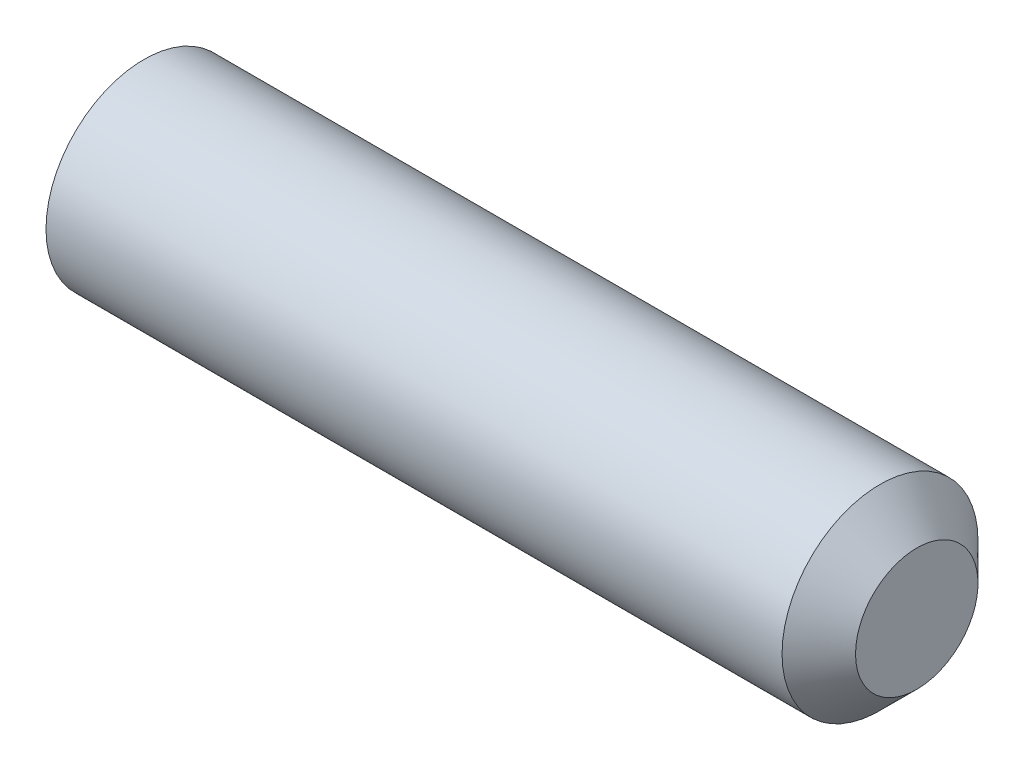
ISO-10303-21;
HEADER;
FILE_DESCRIPTION(('STEP AP214'),'2;1');
FILE_NAME('part.step','',(''),(''),'','','');
FILE_SCHEMA(('AUTOMOTIVE_DESIGN { 1 0 10303 214 1 1 1 1 }'));
ENDSEC;
DATA;
#1=APPLICATION_CONTEXT('core data for automotive mechanical design processes');
#2=APPLICATION_PROTOCOL_DEFINITION('international standard','automotive_design',2000,#1);
#3=PRODUCT_CONTEXT('',#1,'mechanical');
#4=PRODUCT('Part','Part','',(#3));
#5=PRODUCT_RELATED_PRODUCT_CATEGORY('part','',(#4));
#6=PRODUCT_DEFINITION_FORMATION('','',#4);
#7=PRODUCT_DEFINITION_CONTEXT('part definition',#1,'design');
#8=PRODUCT_DEFINITION('design','',#6,#7);
#9=PRODUCT_DEFINITION_SHAPE('','',#8);
#10=(LENGTH_UNIT() NAMED_UNIT(*) SI_UNIT(.MILLI.,.METRE.));
#11=(NAMED_UNIT(*) PLANE_ANGLE_UNIT() SI_UNIT($,.RADIAN.));
#12=(NAMED_UNIT(*) SI_UNIT($,.STERADIAN.) SOLID_ANGLE_UNIT());
#13=UNCERTAINTY_MEASURE_WITH_UNIT(LENGTH_MEASURE(1.E-05),#10,'distance_accuracy_value','');
#14=(GEOMETRIC_REPRESENTATION_CONTEXT(3) GLOBAL_UNCERTAINTY_ASSIGNED_CONTEXT((#13)) GLOBAL_UNIT_ASSIGNED_CONTEXT((#10,
#11,#12)) REPRESENTATION_CONTEXT('',''));
#15=CARTESIAN_POINT('',(0.,0.,0.));
#16=DIRECTION('',(0.,0.,1.));
#17=DIRECTION('',(1.,0.,0.));
#18=AXIS2_PLACEMENT_3D('',#15,#16,#17);
#19=CARTESIAN_POINT('',(0.,0.,0.));
#20=DIRECTION('',(-1.,0.,0.));
#21=DIRECTION('',(0.,0.,1.));
#22=AXIS2_PLACEMENT_3D('',#19,#20,#21);
#23=PLANE('',#22);
#24=CARTESIAN_POINT('',(0.,0.,0.));
#25=DIRECTION('',(-1.,0.,0.));
#26=DIRECTION('',(0.,0.,1.));
#27=AXIS2_PLACEMENT_3D('',#24,#25,#26);
#28=CIRCLE('',#27,1.61);
#29=CARTESIAN_POINT('',(0.,0.,1.61));
#30=VERTEX_POINT('',#29);
#31=EDGE_CURVE('E132',#30,#30,#28,.T.);
#32=ORIENTED_EDGE('',*,*,#31,.T.);
#33=EDGE_LOOP('',(#32));
#34=FACE_BOUND('',#33,.T.);
#35=DIRECTION('',(0.,0.,-1.));
#36=VECTOR('',#35,1.);
#37=CARTESIAN_POINT('',(0.,1.,0.577350269189624));
#38=LINE('',#37,#36);
#39=CARTESIAN_POINT('',(0.,1.,0.577350269189624));
#40=VERTEX_POINT('',#39);
#41=CARTESIAN_POINT('',(0.,1.,-0.577350269189628));
#42=VERTEX_POINT('',#41);
#43=EDGE_CURVE('E123',#40,#42,#38,.T.);
#44=ORIENTED_EDGE('',*,*,#43,.F.);
#45=DIRECTION('',(0.,-0.866025403784439,0.5));
#46=VECTOR('',#45,1.);
#47=CARTESIAN_POINT('',(0.,1.,0.577350269189624));
#48=LINE('',#47,#46);
#49=CARTESIAN_POINT('',(0.,0.,1.15470053837925));
#50=VERTEX_POINT('',#49);
#51=EDGE_CURVE('E45',#40,#50,#48,.T.);
#52=ORIENTED_EDGE('',*,*,#51,.T.);
#53=DIRECTION('',(0.,0.866025403784439,0.5));
#54=VECTOR('',#53,1.);
#55=CARTESIAN_POINT('',(0.,-0.999999999999997,0.577350269189623));
#56=LINE('',#55,#54);
#57=CARTESIAN_POINT('',(0.,-0.999999999999997,0.577350269189623));
#58=VERTEX_POINT('',#57);
#59=EDGE_CURVE('E114',#58,#50,#56,.T.);
#60=ORIENTED_EDGE('',*,*,#59,.F.);
#61=DIRECTION('',(0.,0.,-1.));
#62=VECTOR('',#61,1.);
#63=CARTESIAN_POINT('',(0.,-0.999999999999997,0.577350269189623));
#64=LINE('',#63,#62);
#65=CARTESIAN_POINT('',(0.,-0.999999999999997,-0.577350269189628));
#66=VERTEX_POINT('',#65);
#67=EDGE_CURVE('E117',#58,#66,#64,.T.);
#68=ORIENTED_EDGE('',*,*,#67,.T.);
#69=DIRECTION('',(0.,0.866025403784439,-0.5));
#70=VECTOR('',#69,1.);
#71=CARTESIAN_POINT('',(0.,-0.999999999999997,-0.577350269189628));
#72=LINE('',#71,#70);
#73=CARTESIAN_POINT('',(0.,0.,-1.15470053837925));
#74=VERTEX_POINT('',#73);
#75=EDGE_CURVE('E120',#66,#74,#72,.T.);
#76=ORIENTED_EDGE('',*,*,#75,.T.);
#77=DIRECTION('',(0.,-0.866025403784439,-0.5));
#78=VECTOR('',#77,1.);
#79=CARTESIAN_POINT('',(0.,1.,-0.577350269189628));
#80=LINE('',#79,#78);
#81=EDGE_CURVE('E103',#42,#74,#80,.T.);
#82=ORIENTED_EDGE('',*,*,#81,.F.);
#83=EDGE_LOOP('',(#44,#52,#60,#68,#76,#82));
#84=FACE_BOUND('',#83,.T.);
#85=ADVANCED_FACE('F30',(#34,#84),#23,.T.);
#86=CARTESIAN_POINT('',(16.,1.25,0.));
#87=DIRECTION('',(1.,0.,0.));
#88=DIRECTION('',(0.,0.,-1.));
#89=AXIS2_PLACEMENT_3D('',#86,#87,#88);
#90=PLANE('',#89);
#91=CARTESIAN_POINT('',(16.,0.,0.));
#92=DIRECTION('',(-1.,0.,0.));
#93=DIRECTION('',(0.,0.,1.));
#94=AXIS2_PLACEMENT_3D('',#91,#92,#93);
#95=CIRCLE('',#94,1.25);
#96=CARTESIAN_POINT('',(16.,0.,1.25));
#97=VERTEX_POINT('',#96);
#98=EDGE_CURVE('E11',#97,#97,#95,.T.);
#99=ORIENTED_EDGE('',*,*,#98,.F.);
#100=EDGE_LOOP('',(#99));
#101=FACE_BOUND('',#100,.T.);
#102=ADVANCED_FACE('F32',(#101),#90,.T.);
#103=CARTESIAN_POINT('',(15.25,0.,0.));
#104=DIRECTION('',(-1.,0.,0.));
#105=DIRECTION('',(0.,0.,1.));
#106=AXIS2_PLACEMENT_3D('',#103,#104,#105);
#107=CONICAL_SURFACE('',#106,2.,0.78539816339745);
#108=ORIENTED_EDGE('',*,*,#98,.T.);
#109=EDGE_LOOP('',(#108));
#110=FACE_BOUND('',#109,.T.);
#111=CARTESIAN_POINT('',(15.25,0.,0.));
#112=DIRECTION('',(-1.,0.,0.));
#113=DIRECTION('',(0.,0.,1.));
#114=AXIS2_PLACEMENT_3D('',#111,#112,#113);
#115=CIRCLE('',#114,2.);
#116=CARTESIAN_POINT('',(15.25,0.,2.));
#117=VERTEX_POINT('',#116);
#118=EDGE_CURVE('E38',#117,#117,#115,.T.);
#119=ORIENTED_EDGE('',*,*,#118,.F.);
#120=EDGE_LOOP('',(#119));
#121=FACE_BOUND('',#120,.T.);
#122=ADVANCED_FACE('F143',(#110,#121),#107,.T.);
#123=CARTESIAN_POINT('',(-12.7,0.,0.));
#124=DIRECTION('',(-1.,0.,0.));
#125=DIRECTION('',(0.,0.,1.));
#126=AXIS2_PLACEMENT_3D('',#123,#124,#125);
#127=CYLINDRICAL_SURFACE('',#126,2.);
#128=ORIENTED_EDGE('',*,*,#118,.T.);
#129=EDGE_LOOP('',(#128));
#130=FACE_BOUND('',#129,.T.);
#131=CARTESIAN_POINT('',(0.225166604983952,0.,0.));
#132=DIRECTION('',(-1.,0.,0.));
#133=DIRECTION('',(0.,0.,1.));
#134=AXIS2_PLACEMENT_3D('',#131,#132,#133);
#135=CIRCLE('',#134,2.);
#136=CARTESIAN_POINT('',(0.225166604983952,0.,2.));
#137=VERTEX_POINT('',#136);
#138=EDGE_CURVE('E135',#137,#137,#135,.T.);
#139=ORIENTED_EDGE('',*,*,#138,.F.);
#140=EDGE_LOOP('',(#139));
#141=FACE_BOUND('',#140,.T.);
#142=ADVANCED_FACE('F140',(#130,#141),#127,.T.);
#143=CARTESIAN_POINT('',(0.,0.,0.));
#144=DIRECTION('',(1.,0.,0.));
#145=DIRECTION('',(0.,0.,-1.));
#146=AXIS2_PLACEMENT_3D('',#143,#144,#145);
#147=CONICAL_SURFACE('',#146,1.61,1.0471975511966);
#148=ORIENTED_EDGE('',*,*,#138,.T.);
#149=EDGE_LOOP('',(#148));
#150=FACE_BOUND('',#149,.T.);
#151=ORIENTED_EDGE('',*,*,#31,.F.);
#152=EDGE_LOOP('',(#151));
#153=FACE_BOUND('',#152,.T.);
#154=ADVANCED_FACE('F150',(#150,#153),#147,.T.);
#155=CARTESIAN_POINT('',(2.5,1.,0.577350269189624));
#156=DIRECTION('',(0.,-0.5,-0.866025403784439));
#157=DIRECTION('',(0.,0.866025403784439,-0.5));
#158=AXIS2_PLACEMENT_3D('',#155,#156,#157);
#159=PLANE('',#158);
#160=ORIENTED_EDGE('',*,*,#51,.F.);
#161=DIRECTION('',(-1.,0.,0.));
#162=VECTOR('',#161,1.);
#163=CARTESIAN_POINT('',(2.5,1.,0.577350269189624));
#164=LINE('',#163,#162);
#165=CARTESIAN_POINT('',(2.5,1.,0.577350269189624));
#166=VERTEX_POINT('',#165);
#167=EDGE_CURVE('E50',#166,#40,#164,.T.);
#168=ORIENTED_EDGE('',*,*,#167,.F.);
#169=DIRECTION('',(0.,-0.866025403784439,0.5));
#170=VECTOR('',#169,1.);
#171=CARTESIAN_POINT('',(2.5,1.,0.577350269189624));
#172=LINE('',#171,#170);
#173=CARTESIAN_POINT('',(2.5,0.,1.15470053837925));
#174=VERTEX_POINT('',#173);
#175=EDGE_CURVE('E77',#166,#174,#172,.T.);
#176=ORIENTED_EDGE('',*,*,#175,.T.);
#177=DIRECTION('',(-1.,0.,0.));
#178=VECTOR('',#177,1.);
#179=CARTESIAN_POINT('',(2.5,0.,1.15470053837925));
#180=LINE('',#179,#178);
#181=EDGE_CURVE('E130',#174,#50,#180,.T.);
#182=ORIENTED_EDGE('',*,*,#181,.T.);
#183=EDGE_LOOP('',(#160,#168,#176,#182));
#184=FACE_BOUND('',#183,.T.);
#185=ADVANCED_FACE('F161',(#184),#159,.T.);
#186=CARTESIAN_POINT('',(2.5,-0.999999999999997,0.577350269189623));
#187=DIRECTION('',(0.,-0.5,0.866025403784439));
#188=DIRECTION('',(0.,-0.866025403784439,-0.5));
#189=AXIS2_PLACEMENT_3D('',#186,#187,#188);
#190=PLANE('',#189);
#191=ORIENTED_EDGE('',*,*,#59,.T.);
#192=ORIENTED_EDGE('',*,*,#181,.F.);
#193=DIRECTION('',(0.,0.866025403784439,0.5));
#194=VECTOR('',#193,1.);
#195=CARTESIAN_POINT('',(2.5,-0.999999999999997,0.577350269189623));
#196=LINE('',#195,#194);
#197=CARTESIAN_POINT('',(2.5,-0.999999999999997,0.577350269189623));
#198=VERTEX_POINT('',#197);
#199=EDGE_CURVE('E259',#198,#174,#196,.T.);
#200=ORIENTED_EDGE('',*,*,#199,.F.);
#201=DIRECTION('',(-1.,0.,0.));
#202=VECTOR('',#201,1.);
#203=CARTESIAN_POINT('',(2.5,-0.999999999999997,0.577350269189623));
#204=LINE('',#203,#202);
#205=EDGE_CURVE('E128',#198,#58,#204,.T.);
#206=ORIENTED_EDGE('',*,*,#205,.T.);
#207=EDGE_LOOP('',(#191,#192,#200,#206));
#208=FACE_BOUND('',#207,.T.);
#209=ADVANCED_FACE('F168',(#208),#190,.F.);
#210=CARTESIAN_POINT('',(2.5,-0.999999999999997,0.577350269189623));
#211=DIRECTION('',(0.,1.,0.));
#212=DIRECTION('',(0.,0.,1.));
#213=AXIS2_PLACEMENT_3D('',#210,#211,#212);
#214=PLANE('',#213);
#215=ORIENTED_EDGE('',*,*,#67,.F.);
#216=ORIENTED_EDGE('',*,*,#205,.F.);
#217=DIRECTION('',(0.,0.,-1.));
#218=VECTOR('',#217,1.);
#219=CARTESIAN_POINT('',(2.5,-0.999999999999997,0.577350269189623));
#220=LINE('',#219,#218);
#221=CARTESIAN_POINT('',(2.5,-0.999999999999997,-0.577350269189628));
#222=VERTEX_POINT('',#221);
#223=EDGE_CURVE('E98',#198,#222,#220,.T.);
#224=ORIENTED_EDGE('',*,*,#223,.T.);
#225=DIRECTION('',(-1.,0.,0.));
#226=VECTOR('',#225,1.);
#227=CARTESIAN_POINT('',(2.5,-0.999999999999997,-0.577350269189628));
#228=LINE('',#227,#226);
#229=EDGE_CURVE('E93',#222,#66,#228,.T.);
#230=ORIENTED_EDGE('',*,*,#229,.T.);
#231=EDGE_LOOP('',(#215,#216,#224,#230));
#232=FACE_BOUND('',#231,.T.);
#233=ADVANCED_FACE('F175',(#232),#214,.T.);
#234=CARTESIAN_POINT('',(2.5,-0.999999999999997,-0.577350269189628));
#235=DIRECTION('',(0.,0.5,0.866025403784439));
#236=DIRECTION('',(0.,-0.866025403784439,0.5));
#237=AXIS2_PLACEMENT_3D('',#234,#235,#236);
#238=PLANE('',#237);
#239=ORIENTED_EDGE('',*,*,#75,.F.);
#240=ORIENTED_EDGE('',*,*,#229,.F.);
#241=DIRECTION('',(0.,0.866025403784439,-0.5));
#242=VECTOR('',#241,1.);
#243=CARTESIAN_POINT('',(2.5,-0.999999999999997,-0.577350269189628));
#244=LINE('',#243,#242);
#245=CARTESIAN_POINT('',(2.5,0.,-1.15470053837925));
#246=VERTEX_POINT('',#245);
#247=EDGE_CURVE('E88',#222,#246,#244,.T.);
#248=ORIENTED_EDGE('',*,*,#247,.T.);
#249=DIRECTION('',(-1.,0.,0.));
#250=VECTOR('',#249,1.);
#251=CARTESIAN_POINT('',(2.5,0.,-1.15470053837925));
#252=LINE('',#251,#250);
#253=EDGE_CURVE('E92',#246,#74,#252,.T.);
#254=ORIENTED_EDGE('',*,*,#253,.T.);
#255=EDGE_LOOP('',(#239,#240,#248,#254));
#256=FACE_BOUND('',#255,.T.);
#257=ADVANCED_FACE('F91',(#256),#238,.T.);
#258=CARTESIAN_POINT('',(2.5,1.,-0.577350269189628));
#259=DIRECTION('',(0.,0.5,-0.866025403784439));
#260=DIRECTION('',(0.,0.866025403784439,0.5));
#261=AXIS2_PLACEMENT_3D('',#258,#259,#260);
#262=PLANE('',#261);
#263=ORIENTED_EDGE('',*,*,#81,.T.);
#264=ORIENTED_EDGE('',*,*,#253,.F.);
#265=DIRECTION('',(0.,-0.866025403784439,-0.5));
#266=VECTOR('',#265,1.);
#267=CARTESIAN_POINT('',(2.5,1.,-0.577350269189628));
#268=LINE('',#267,#266);
#269=CARTESIAN_POINT('',(2.5,1.,-0.577350269189628));
#270=VERTEX_POINT('',#269);
#271=EDGE_CURVE('E97',#270,#246,#268,.T.);
#272=ORIENTED_EDGE('',*,*,#271,.F.);
#273=DIRECTION('',(-1.,0.,0.));
#274=VECTOR('',#273,1.);
#275=CARTESIAN_POINT('',(2.5,1.,-0.577350269189628));
#276=LINE('',#275,#274);
#277=EDGE_CURVE('E73',#270,#42,#276,.T.);
#278=ORIENTED_EDGE('',*,*,#277,.T.);
#279=EDGE_LOOP('',(#263,#264,#272,#278));
#280=FACE_BOUND('',#279,.T.);
#281=ADVANCED_FACE('F100',(#280),#262,.F.);
#282=CARTESIAN_POINT('',(2.5,1.,0.577350269189624));
#283=DIRECTION('',(0.,1.,0.));
#284=DIRECTION('',(0.,0.,1.));
#285=AXIS2_PLACEMENT_3D('',#282,#283,#284);
#286=PLANE('',#285);
#287=ORIENTED_EDGE('',*,*,#43,.T.);
#288=ORIENTED_EDGE('',*,*,#277,.F.);
#289=DIRECTION('',(0.,0.,-1.));
#290=VECTOR('',#289,1.);
#291=CARTESIAN_POINT('',(2.5,1.,0.577350269189624));
#292=LINE('',#291,#290);
#293=EDGE_CURVE('E108',#166,#270,#292,.T.);
#294=ORIENTED_EDGE('',*,*,#293,.F.);
#295=ORIENTED_EDGE('',*,*,#167,.T.);
#296=EDGE_LOOP('',(#287,#288,#294,#295));
#297=FACE_BOUND('',#296,.T.);
#298=ADVANCED_FACE('F187',(#297),#286,.F.);
#299=CARTESIAN_POINT('',(2.5,1.,0.577350269189624));
#300=DIRECTION('',(1.,0.,0.));
#301=DIRECTION('',(0.,0.,-1.));
#302=AXIS2_PLACEMENT_3D('',#299,#300,#301);
#303=PLANE('',#302);
#304=ORIENTED_EDGE('',*,*,#175,.F.);
#305=ORIENTED_EDGE('',*,*,#293,.T.);
#306=ORIENTED_EDGE('',*,*,#271,.T.);
#307=ORIENTED_EDGE('',*,*,#247,.F.);
#308=ORIENTED_EDGE('',*,*,#223,.F.);
#309=ORIENTED_EDGE('',*,*,#199,.T.);
#310=EDGE_LOOP('',(#304,#305,#306,#307,#308,#309));
#311=FACE_BOUND('',#310,.T.);
#312=ADVANCED_FACE('F106',(#311),#303,.F.);
#313=CLOSED_SHELL('',(#85,#102,#122,#142,#154,#185,#209,#233,#257,#281,#298,#312));
#314=MANIFOLD_SOLID_BREP('B2',#313);
#315=ADVANCED_BREP_SHAPE_REPRESENTATION('',(#18,#314),#14);
#316=SHAPE_DEFINITION_REPRESENTATION(#9,#315);
ENDSEC;
END-ISO-10303-21;
